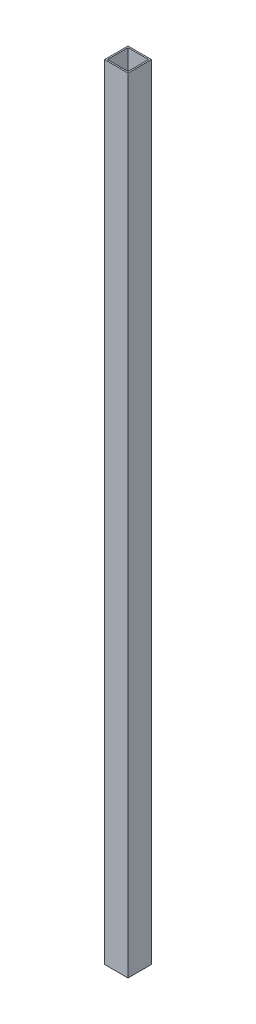
ISO-10303-21;
HEADER;
FILE_DESCRIPTION(('STEP AP214'),'2;1');
FILE_NAME('part.step','',(''),(''),'','','');
FILE_SCHEMA(('AUTOMOTIVE_DESIGN { 1 0 10303 214 1 1 1 1 }'));
ENDSEC;
DATA;
#1=APPLICATION_CONTEXT('core data for automotive mechanical design processes');
#2=APPLICATION_PROTOCOL_DEFINITION('international standard','automotive_design',2000,#1);
#3=PRODUCT_CONTEXT('',#1,'mechanical');
#4=PRODUCT('Part','Part','',(#3));
#5=PRODUCT_RELATED_PRODUCT_CATEGORY('part','',(#4));
#6=PRODUCT_DEFINITION_FORMATION('','',#4);
#7=PRODUCT_DEFINITION_CONTEXT('part definition',#1,'design');
#8=PRODUCT_DEFINITION('design','',#6,#7);
#9=PRODUCT_DEFINITION_SHAPE('','',#8);
#10=(LENGTH_UNIT() NAMED_UNIT(*) SI_UNIT(.MILLI.,.METRE.));
#11=(NAMED_UNIT(*) PLANE_ANGLE_UNIT() SI_UNIT($,.RADIAN.));
#12=(NAMED_UNIT(*) SI_UNIT($,.STERADIAN.) SOLID_ANGLE_UNIT());
#13=UNCERTAINTY_MEASURE_WITH_UNIT(LENGTH_MEASURE(1.E-05),#10,'distance_accuracy_value','');
#14=(GEOMETRIC_REPRESENTATION_CONTEXT(3) GLOBAL_UNCERTAINTY_ASSIGNED_CONTEXT((#13)) GLOBAL_UNIT_ASSIGNED_CONTEXT((#10,
#11,#12)) REPRESENTATION_CONTEXT('',''));
#15=CARTESIAN_POINT('',(0.,0.,0.));
#16=DIRECTION('',(0.,0.,1.));
#17=DIRECTION('',(1.,0.,0.));
#18=AXIS2_PLACEMENT_3D('',#15,#16,#17);
#19=CARTESIAN_POINT('',(0.,848.868,0.));
#20=DIRECTION('',(0.,1.,0.));
#21=DIRECTION('',(0.,0.,1.));
#22=AXIS2_PLACEMENT_3D('',#19,#20,#21);
#23=PLANE('',#22);
#24=DIRECTION('',(0.,0.,1.));
#25=VECTOR('',#24,1.);
#26=CARTESIAN_POINT('',(-14.5550561797753,848.868,-17.2662921348315));
#27=LINE('',#26,#25);
#28=CARTESIAN_POINT('',(-14.5550561797753,848.868,-17.2662921348315));
#29=VERTEX_POINT('',#28);
#30=CARTESIAN_POINT('',(-14.5550561797753,848.868,8.13370786516854));
#31=VERTEX_POINT('',#30);
#32=EDGE_CURVE('E153',#29,#31,#27,.T.);
#33=ORIENTED_EDGE('',*,*,#32,.T.);
#34=DIRECTION('',(1.,0.,0.));
#35=VECTOR('',#34,1.);
#36=CARTESIAN_POINT('',(-14.5550561797753,848.868,8.13370786516854));
#37=LINE('',#36,#35);
#38=CARTESIAN_POINT('',(10.8449438202247,848.868,8.13370786516854));
#39=VERTEX_POINT('',#38);
#40=EDGE_CURVE('E157',#31,#39,#37,.T.);
#41=ORIENTED_EDGE('',*,*,#40,.T.);
#42=DIRECTION('',(0.,0.,-1.));
#43=VECTOR('',#42,1.);
#44=CARTESIAN_POINT('',(10.8449438202247,848.868,-17.2662921348315));
#45=LINE('',#44,#43);
#46=CARTESIAN_POINT('',(10.8449438202247,848.868,-17.2662921348315));
#47=VERTEX_POINT('',#46);
#48=EDGE_CURVE('E161',#39,#47,#45,.T.);
#49=ORIENTED_EDGE('',*,*,#48,.T.);
#50=DIRECTION('',(-1.,0.,0.));
#51=VECTOR('',#50,1.);
#52=CARTESIAN_POINT('',(-14.5550561797753,848.868,-17.2662921348315));
#53=LINE('',#52,#51);
#54=EDGE_CURVE('E164',#47,#29,#53,.T.);
#55=ORIENTED_EDGE('',*,*,#54,.T.);
#56=EDGE_LOOP('',(#33,#41,#49,#55));
#57=FACE_BOUND('',#56,.T.);
#58=DIRECTION('',(1.,0.,0.));
#59=VECTOR('',#58,1.);
#60=CARTESIAN_POINT('',(-13.0310561797753,848.868,6.60970786516855));
#61=LINE('',#60,#59);
#62=CARTESIAN_POINT('',(-13.0310561797753,848.868,6.60970786516855));
#63=VERTEX_POINT('',#62);
#64=CARTESIAN_POINT('',(9.3209438202247,848.868,6.60970786516855));
#65=VERTEX_POINT('',#64);
#66=EDGE_CURVE('E114',#63,#65,#61,.T.);
#67=ORIENTED_EDGE('',*,*,#66,.F.);
#68=DIRECTION('',(0.,0.,1.));
#69=VECTOR('',#68,1.);
#70=CARTESIAN_POINT('',(-13.0310561797753,848.868,-15.7422921348315));
#71=LINE('',#70,#69);
#72=CARTESIAN_POINT('',(-13.0310561797753,848.868,-15.7422921348315));
#73=VERTEX_POINT('',#72);
#74=EDGE_CURVE('E105',#73,#63,#71,.T.);
#75=ORIENTED_EDGE('',*,*,#74,.F.);
#76=DIRECTION('',(-1.,0.,0.));
#77=VECTOR('',#76,1.);
#78=CARTESIAN_POINT('',(-13.0310561797753,848.868,-15.7422921348315));
#79=LINE('',#78,#77);
#80=CARTESIAN_POINT('',(9.3209438202247,848.868,-15.7422921348315));
#81=VERTEX_POINT('',#80);
#82=EDGE_CURVE('E131',#81,#73,#79,.T.);
#83=ORIENTED_EDGE('',*,*,#82,.F.);
#84=DIRECTION('',(0.,0.,-1.));
#85=VECTOR('',#84,1.);
#86=CARTESIAN_POINT('',(9.3209438202247,848.868,-15.7422921348315));
#87=LINE('',#86,#85);
#88=EDGE_CURVE('E127',#65,#81,#87,.T.);
#89=ORIENTED_EDGE('',*,*,#88,.F.);
#90=EDGE_LOOP('',(#67,#75,#83,#89));
#91=FACE_BOUND('',#90,.T.);
#92=ADVANCED_FACE('F39',(#57,#91),#23,.T.);
#93=CARTESIAN_POINT('',(0.,0.,0.));
#94=DIRECTION('',(0.,1.,0.));
#95=DIRECTION('',(0.,0.,1.));
#96=AXIS2_PLACEMENT_3D('',#93,#94,#95);
#97=PLANE('',#96);
#98=DIRECTION('',(0.,0.,1.));
#99=VECTOR('',#98,1.);
#100=CARTESIAN_POINT('',(-14.5550561797753,0.,-17.2662921348315));
#101=LINE('',#100,#99);
#102=CARTESIAN_POINT('',(-14.5550561797753,0.,-17.2662921348315));
#103=VERTEX_POINT('',#102);
#104=CARTESIAN_POINT('',(-14.5550561797753,0.,8.13370786516854));
#105=VERTEX_POINT('',#104);
#106=EDGE_CURVE('E123',#103,#105,#101,.T.);
#107=ORIENTED_EDGE('',*,*,#106,.F.);
#108=DIRECTION('',(-1.,0.,0.));
#109=VECTOR('',#108,1.);
#110=CARTESIAN_POINT('',(-14.5550561797753,0.,-17.2662921348315));
#111=LINE('',#110,#109);
#112=CARTESIAN_POINT('',(10.8449438202247,0.,-17.2662921348315));
#113=VERTEX_POINT('',#112);
#114=EDGE_CURVE('E158',#113,#103,#111,.T.);
#115=ORIENTED_EDGE('',*,*,#114,.F.);
#116=DIRECTION('',(0.,0.,-1.));
#117=VECTOR('',#116,1.);
#118=CARTESIAN_POINT('',(10.8449438202247,0.,-17.2662921348315));
#119=LINE('',#118,#117);
#120=CARTESIAN_POINT('',(10.8449438202247,0.,8.13370786516854));
#121=VERTEX_POINT('',#120);
#122=EDGE_CURVE('E174',#121,#113,#119,.T.);
#123=ORIENTED_EDGE('',*,*,#122,.F.);
#124=DIRECTION('',(1.,0.,0.));
#125=VECTOR('',#124,1.);
#126=CARTESIAN_POINT('',(-14.5550561797753,0.,8.13370786516854));
#127=LINE('',#126,#125);
#128=EDGE_CURVE('E171',#105,#121,#127,.T.);
#129=ORIENTED_EDGE('',*,*,#128,.F.);
#130=EDGE_LOOP('',(#107,#115,#123,#129));
#131=FACE_BOUND('',#130,.T.);
#132=DIRECTION('',(0.,0.,1.));
#133=VECTOR('',#132,1.);
#134=CARTESIAN_POINT('',(-13.0310561797753,0.,-15.7422921348315));
#135=LINE('',#134,#133);
#136=CARTESIAN_POINT('',(-13.0310561797753,0.,-15.7422921348315));
#137=VERTEX_POINT('',#136);
#138=CARTESIAN_POINT('',(-13.0310561797753,0.,6.60970786516855));
#139=VERTEX_POINT('',#138);
#140=EDGE_CURVE('E63',#137,#139,#135,.T.);
#141=ORIENTED_EDGE('',*,*,#140,.T.);
#142=DIRECTION('',(1.,0.,0.));
#143=VECTOR('',#142,1.);
#144=CARTESIAN_POINT('',(-13.0310561797753,0.,6.60970786516855));
#145=LINE('',#144,#143);
#146=CARTESIAN_POINT('',(9.3209438202247,0.,6.60970786516855));
#147=VERTEX_POINT('',#146);
#148=EDGE_CURVE('E121',#139,#147,#145,.T.);
#149=ORIENTED_EDGE('',*,*,#148,.T.);
#150=DIRECTION('',(0.,0.,-1.));
#151=VECTOR('',#150,1.);
#152=CARTESIAN_POINT('',(9.3209438202247,0.,-15.7422921348315));
#153=LINE('',#152,#151);
#154=CARTESIAN_POINT('',(9.3209438202247,0.,-15.7422921348315));
#155=VERTEX_POINT('',#154);
#156=EDGE_CURVE('E140',#147,#155,#153,.T.);
#157=ORIENTED_EDGE('',*,*,#156,.T.);
#158=DIRECTION('',(-1.,0.,0.));
#159=VECTOR('',#158,1.);
#160=CARTESIAN_POINT('',(-13.0310561797753,0.,-15.7422921348315));
#161=LINE('',#160,#159);
#162=EDGE_CURVE('E115',#155,#137,#161,.T.);
#163=ORIENTED_EDGE('',*,*,#162,.T.);
#164=EDGE_LOOP('',(#141,#149,#157,#163));
#165=FACE_BOUND('',#164,.T.);
#166=ADVANCED_FACE('F197',(#131,#165),#97,.F.);
#167=CARTESIAN_POINT('',(-14.5550561797753,848.868,-17.2662921348315));
#168=DIRECTION('',(1.,0.,0.));
#169=DIRECTION('',(0.,0.,-1.));
#170=AXIS2_PLACEMENT_3D('',#167,#168,#169);
#171=PLANE('',#170);
#172=ORIENTED_EDGE('',*,*,#106,.T.);
#173=DIRECTION('',(0.,-1.,0.));
#174=VECTOR('',#173,1.);
#175=CARTESIAN_POINT('',(-14.5550561797753,848.868,8.13370786516854));
#176=LINE('',#175,#174);
#177=EDGE_CURVE('E11',#31,#105,#176,.T.);
#178=ORIENTED_EDGE('',*,*,#177,.F.);
#179=ORIENTED_EDGE('',*,*,#32,.F.);
#180=DIRECTION('',(0.,-1.,0.));
#181=VECTOR('',#180,1.);
#182=CARTESIAN_POINT('',(-14.5550561797753,848.868,-17.2662921348315));
#183=LINE('',#182,#181);
#184=EDGE_CURVE('E167',#29,#103,#183,.T.);
#185=ORIENTED_EDGE('',*,*,#184,.T.);
#186=EDGE_LOOP('',(#172,#178,#179,#185));
#187=FACE_BOUND('',#186,.T.);
#188=ADVANCED_FACE('F41',(#187),#171,.F.);
#189=CARTESIAN_POINT('',(-14.5550561797753,848.868,8.13370786516854));
#190=DIRECTION('',(0.,0.,-1.));
#191=DIRECTION('',(-1.,0.,0.));
#192=AXIS2_PLACEMENT_3D('',#189,#190,#191);
#193=PLANE('',#192);
#194=ORIENTED_EDGE('',*,*,#128,.T.);
#195=DIRECTION('',(0.,-1.,0.));
#196=VECTOR('',#195,1.);
#197=CARTESIAN_POINT('',(10.8449438202247,848.868,8.13370786516854));
#198=LINE('',#197,#196);
#199=EDGE_CURVE('E48',#39,#121,#198,.T.);
#200=ORIENTED_EDGE('',*,*,#199,.F.);
#201=ORIENTED_EDGE('',*,*,#40,.F.);
#202=ORIENTED_EDGE('',*,*,#177,.T.);
#203=EDGE_LOOP('',(#194,#200,#201,#202));
#204=FACE_BOUND('',#203,.T.);
#205=ADVANCED_FACE('F207',(#204),#193,.F.);
#206=CARTESIAN_POINT('',(10.8449438202247,848.868,-17.2662921348315));
#207=DIRECTION('',(-1.,0.,0.));
#208=DIRECTION('',(0.,0.,1.));
#209=AXIS2_PLACEMENT_3D('',#206,#207,#208);
#210=PLANE('',#209);
#211=ORIENTED_EDGE('',*,*,#122,.T.);
#212=DIRECTION('',(0.,-1.,0.));
#213=VECTOR('',#212,1.);
#214=CARTESIAN_POINT('',(10.8449438202247,848.868,-17.2662921348315));
#215=LINE('',#214,#213);
#216=EDGE_CURVE('E182',#47,#113,#215,.T.);
#217=ORIENTED_EDGE('',*,*,#216,.F.);
#218=ORIENTED_EDGE('',*,*,#48,.F.);
#219=ORIENTED_EDGE('',*,*,#199,.T.);
#220=EDGE_LOOP('',(#211,#217,#218,#219));
#221=FACE_BOUND('',#220,.T.);
#222=ADVANCED_FACE('F191',(#221),#210,.F.);
#223=CARTESIAN_POINT('',(-14.5550561797753,848.868,-17.2662921348315));
#224=DIRECTION('',(0.,0.,1.));
#225=DIRECTION('',(1.,0.,0.));
#226=AXIS2_PLACEMENT_3D('',#223,#224,#225);
#227=PLANE('',#226);
#228=ORIENTED_EDGE('',*,*,#114,.T.);
#229=ORIENTED_EDGE('',*,*,#184,.F.);
#230=ORIENTED_EDGE('',*,*,#54,.F.);
#231=ORIENTED_EDGE('',*,*,#216,.T.);
#232=EDGE_LOOP('',(#228,#229,#230,#231));
#233=FACE_BOUND('',#232,.T.);
#234=ADVANCED_FACE('F201',(#233),#227,.F.);
#235=CARTESIAN_POINT('',(-13.0310561797753,848.868,-15.7422921348315));
#236=DIRECTION('',(1.,0.,0.));
#237=DIRECTION('',(0.,0.,-1.));
#238=AXIS2_PLACEMENT_3D('',#235,#236,#237);
#239=PLANE('',#238);
#240=ORIENTED_EDGE('',*,*,#140,.F.);
#241=DIRECTION('',(0.,-1.,0.));
#242=VECTOR('',#241,1.);
#243=CARTESIAN_POINT('',(-13.0310561797753,848.868,-15.7422921348315));
#244=LINE('',#243,#242);
#245=EDGE_CURVE('E109',#73,#137,#244,.T.);
#246=ORIENTED_EDGE('',*,*,#245,.F.);
#247=ORIENTED_EDGE('',*,*,#74,.T.);
#248=DIRECTION('',(0.,-1.,0.));
#249=VECTOR('',#248,1.);
#250=CARTESIAN_POINT('',(-13.0310561797753,848.868,6.60970786516855));
#251=LINE('',#250,#249);
#252=EDGE_CURVE('E108',#63,#139,#251,.T.);
#253=ORIENTED_EDGE('',*,*,#252,.T.);
#254=EDGE_LOOP('',(#240,#246,#247,#253));
#255=FACE_BOUND('',#254,.T.);
#256=ADVANCED_FACE('F107',(#255),#239,.T.);
#257=CARTESIAN_POINT('',(-13.0310561797753,848.868,6.60970786516855));
#258=DIRECTION('',(0.,0.,-1.));
#259=DIRECTION('',(-1.,0.,0.));
#260=AXIS2_PLACEMENT_3D('',#257,#258,#259);
#261=PLANE('',#260);
#262=ORIENTED_EDGE('',*,*,#148,.F.);
#263=ORIENTED_EDGE('',*,*,#252,.F.);
#264=ORIENTED_EDGE('',*,*,#66,.T.);
#265=DIRECTION('',(0.,-1.,0.));
#266=VECTOR('',#265,1.);
#267=CARTESIAN_POINT('',(9.3209438202247,848.868,6.60970786516855));
#268=LINE('',#267,#266);
#269=EDGE_CURVE('E124',#65,#147,#268,.T.);
#270=ORIENTED_EDGE('',*,*,#269,.T.);
#271=EDGE_LOOP('',(#262,#263,#264,#270));
#272=FACE_BOUND('',#271,.T.);
#273=ADVANCED_FACE('F118',(#272),#261,.T.);
#274=CARTESIAN_POINT('',(9.3209438202247,848.868,-15.7422921348315));
#275=DIRECTION('',(-1.,0.,0.));
#276=DIRECTION('',(0.,0.,1.));
#277=AXIS2_PLACEMENT_3D('',#274,#275,#276);
#278=PLANE('',#277);
#279=ORIENTED_EDGE('',*,*,#156,.F.);
#280=ORIENTED_EDGE('',*,*,#269,.F.);
#281=ORIENTED_EDGE('',*,*,#88,.T.);
#282=DIRECTION('',(0.,-1.,0.));
#283=VECTOR('',#282,1.);
#284=CARTESIAN_POINT('',(9.3209438202247,848.868,-15.7422921348315));
#285=LINE('',#284,#283);
#286=EDGE_CURVE('E55',#81,#155,#285,.T.);
#287=ORIENTED_EDGE('',*,*,#286,.T.);
#288=EDGE_LOOP('',(#279,#280,#281,#287));
#289=FACE_BOUND('',#288,.T.);
#290=ADVANCED_FACE('F230',(#289),#278,.T.);
#291=CARTESIAN_POINT('',(-13.0310561797753,848.868,-15.7422921348315));
#292=DIRECTION('',(0.,0.,1.));
#293=DIRECTION('',(1.,0.,0.));
#294=AXIS2_PLACEMENT_3D('',#291,#292,#293);
#295=PLANE('',#294);
#296=ORIENTED_EDGE('',*,*,#162,.F.);
#297=ORIENTED_EDGE('',*,*,#286,.F.);
#298=ORIENTED_EDGE('',*,*,#82,.T.);
#299=ORIENTED_EDGE('',*,*,#245,.T.);
#300=EDGE_LOOP('',(#296,#297,#298,#299));
#301=FACE_BOUND('',#300,.T.);
#302=ADVANCED_FACE('F234',(#301),#295,.T.);
#303=CLOSED_SHELL('',(#92,#166,#188,#205,#222,#234,#256,#273,#290,#302));
#304=MANIFOLD_SOLID_BREP('B2',#303);
#305=ADVANCED_BREP_SHAPE_REPRESENTATION('',(#18,#304),#14);
#306=SHAPE_DEFINITION_REPRESENTATION(#9,#305);
ENDSEC;
END-ISO-10303-21;
